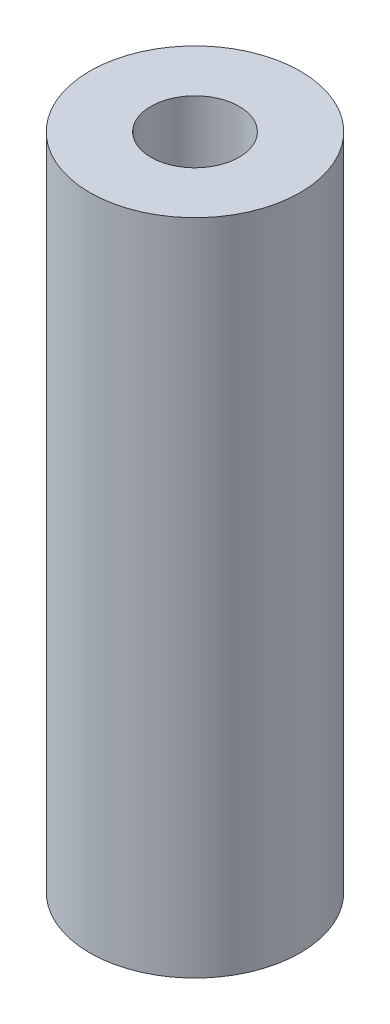
ISO-10303-21;
HEADER;
FILE_DESCRIPTION(('STEP AP214'),'2;1');
FILE_NAME('part.step','',(''),(''),'','','');
FILE_SCHEMA(('AUTOMOTIVE_DESIGN { 1 0 10303 214 1 1 1 1 }'));
ENDSEC;
DATA;
#1=APPLICATION_CONTEXT('core data for automotive mechanical design processes');
#2=APPLICATION_PROTOCOL_DEFINITION('international standard','automotive_design',2000,#1);
#3=PRODUCT_CONTEXT('',#1,'mechanical');
#4=PRODUCT('Part','Part','',(#3));
#5=PRODUCT_RELATED_PRODUCT_CATEGORY('part','',(#4));
#6=PRODUCT_DEFINITION_FORMATION('','',#4);
#7=PRODUCT_DEFINITION_CONTEXT('part definition',#1,'design');
#8=PRODUCT_DEFINITION('design','',#6,#7);
#9=PRODUCT_DEFINITION_SHAPE('','',#8);
#10=(LENGTH_UNIT() NAMED_UNIT(*) SI_UNIT(.MILLI.,.METRE.));
#11=(NAMED_UNIT(*) PLANE_ANGLE_UNIT() SI_UNIT($,.RADIAN.));
#12=(NAMED_UNIT(*) SI_UNIT($,.STERADIAN.) SOLID_ANGLE_UNIT());
#13=UNCERTAINTY_MEASURE_WITH_UNIT(LENGTH_MEASURE(1.E-05),#10,'distance_accuracy_value','');
#14=(GEOMETRIC_REPRESENTATION_CONTEXT(3) GLOBAL_UNCERTAINTY_ASSIGNED_CONTEXT((#13)) GLOBAL_UNIT_ASSIGNED_CONTEXT((#10,
#11,#12)) REPRESENTATION_CONTEXT('',''));
#15=CARTESIAN_POINT('',(0.,0.,0.));
#16=DIRECTION('',(0.,0.,1.));
#17=DIRECTION('',(1.,0.,0.));
#18=AXIS2_PLACEMENT_3D('',#15,#16,#17);
#19=CARTESIAN_POINT('',(0.,48.5,0.));
#20=DIRECTION('',(0.,-1.,0.));
#21=DIRECTION('',(0.,0.,-1.));
#22=AXIS2_PLACEMENT_3D('',#19,#20,#21);
#23=CYLINDRICAL_SURFACE('',#22,6.5);
#24=CARTESIAN_POINT('',(0.,48.5,0.));
#25=DIRECTION('',(0.,1.,0.));
#26=DIRECTION('',(0.,0.,1.));
#27=AXIS2_PLACEMENT_3D('',#24,#25,#26);
#28=CIRCLE('',#27,6.5);
#29=CARTESIAN_POINT('',(0.,48.5,6.5));
#30=VERTEX_POINT('',#29);
#31=EDGE_CURVE('E39',#30,#30,#28,.T.);
#32=ORIENTED_EDGE('',*,*,#31,.T.);
#33=EDGE_LOOP('',(#32));
#34=FACE_BOUND('',#33,.T.);
#35=CARTESIAN_POINT('',(0.,-48.5,0.));
#36=DIRECTION('',(0.,1.,0.));
#37=DIRECTION('',(0.,0.,1.));
#38=AXIS2_PLACEMENT_3D('',#35,#36,#37);
#39=CIRCLE('',#38,6.5);
#40=CARTESIAN_POINT('',(0.,-48.5,6.5));
#41=VERTEX_POINT('',#40);
#42=EDGE_CURVE('E45',#41,#41,#39,.T.);
#43=ORIENTED_EDGE('',*,*,#42,.F.);
#44=EDGE_LOOP('',(#43));
#45=FACE_BOUND('',#44,.T.);
#46=ADVANCED_FACE('F32',(#34,#45),#23,.F.);
#47=CARTESIAN_POINT('',(0.,48.5,0.));
#48=DIRECTION('',(0.,-1.,0.));
#49=DIRECTION('',(0.,0.,-1.));
#50=AXIS2_PLACEMENT_3D('',#47,#48,#49);
#51=CYLINDRICAL_SURFACE('',#50,15.5);
#52=CARTESIAN_POINT('',(0.,48.5,0.));
#53=DIRECTION('',(0.,1.,0.));
#54=DIRECTION('',(0.,0.,1.));
#55=AXIS2_PLACEMENT_3D('',#52,#53,#54);
#56=CIRCLE('',#55,15.5);
#57=CARTESIAN_POINT('',(0.,48.5,15.5));
#58=VERTEX_POINT('',#57);
#59=EDGE_CURVE('E10',#58,#58,#56,.T.);
#60=ORIENTED_EDGE('',*,*,#59,.F.);
#61=EDGE_LOOP('',(#60));
#62=FACE_BOUND('',#61,.T.);
#63=CARTESIAN_POINT('',(0.,-48.5,0.));
#64=DIRECTION('',(0.,1.,0.));
#65=DIRECTION('',(0.,0.,1.));
#66=AXIS2_PLACEMENT_3D('',#63,#64,#65);
#67=CIRCLE('',#66,15.5);
#68=CARTESIAN_POINT('',(0.,-48.5,15.5));
#69=VERTEX_POINT('',#68);
#70=EDGE_CURVE('E35',#69,#69,#67,.T.);
#71=ORIENTED_EDGE('',*,*,#70,.T.);
#72=EDGE_LOOP('',(#71));
#73=FACE_BOUND('',#72,.T.);
#74=ADVANCED_FACE('F52',(#62,#73),#51,.T.);
#75=CARTESIAN_POINT('',(0.,48.5,0.));
#76=DIRECTION('',(0.,1.,0.));
#77=DIRECTION('',(0.,0.,1.));
#78=AXIS2_PLACEMENT_3D('',#75,#76,#77);
#79=PLANE('',#78);
#80=ORIENTED_EDGE('',*,*,#31,.F.);
#81=EDGE_LOOP('',(#80));
#82=FACE_BOUND('',#81,.T.);
#83=ORIENTED_EDGE('',*,*,#59,.T.);
#84=EDGE_LOOP('',(#83));
#85=FACE_BOUND('',#84,.T.);
#86=ADVANCED_FACE('F56',(#82,#85),#79,.T.);
#87=CARTESIAN_POINT('',(0.,-48.5,0.));
#88=DIRECTION('',(0.,1.,0.));
#89=DIRECTION('',(0.,0.,1.));
#90=AXIS2_PLACEMENT_3D('',#87,#88,#89);
#91=PLANE('',#90);
#92=ORIENTED_EDGE('',*,*,#42,.T.);
#93=EDGE_LOOP('',(#92));
#94=FACE_BOUND('',#93,.T.);
#95=ORIENTED_EDGE('',*,*,#70,.F.);
#96=EDGE_LOOP('',(#95));
#97=FACE_BOUND('',#96,.T.);
#98=ADVANCED_FACE('F54',(#94,#97),#91,.F.);
#99=CLOSED_SHELL('',(#46,#74,#86,#98));
#100=MANIFOLD_SOLID_BREP('B2',#99);
#101=ADVANCED_BREP_SHAPE_REPRESENTATION('',(#18,#100),#14);
#102=SHAPE_DEFINITION_REPRESENTATION(#9,#101);
ENDSEC;
END-ISO-10303-21;
